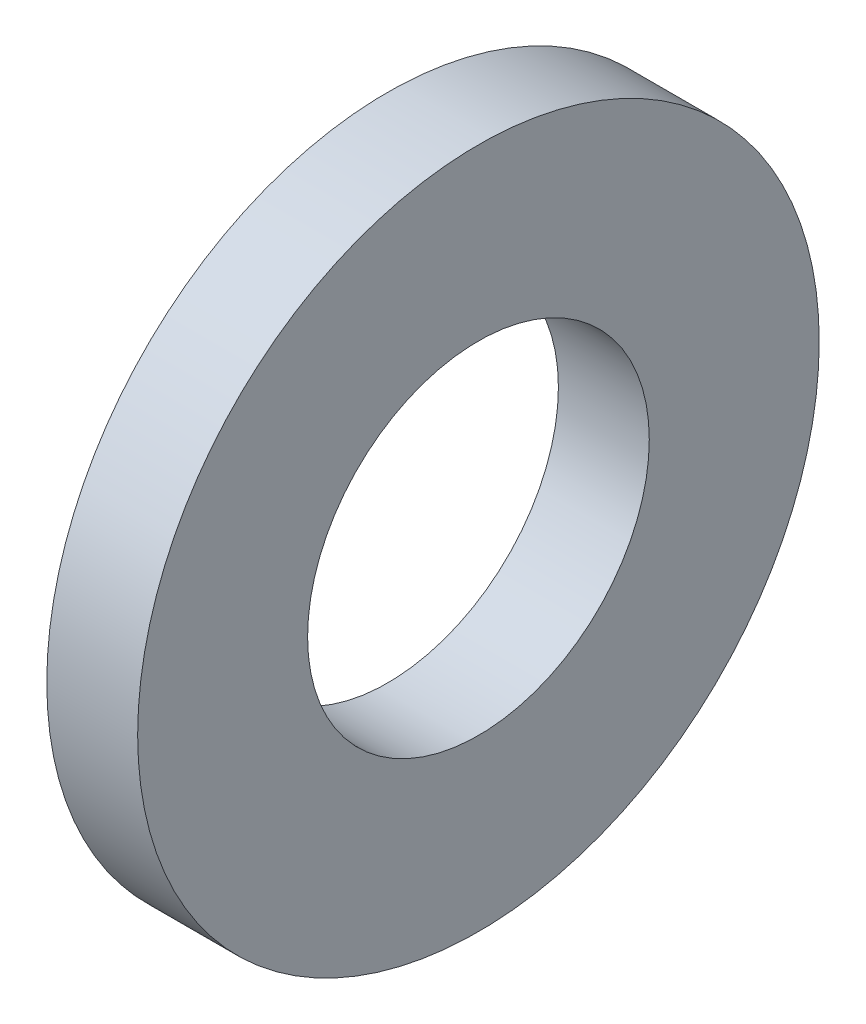
ISO-10303-21;
HEADER;
FILE_DESCRIPTION(('STEP AP214'),'2;1');
FILE_NAME('part.step','',(''),(''),'','','');
FILE_SCHEMA(('AUTOMOTIVE_DESIGN { 1 0 10303 214 1 1 1 1 }'));
ENDSEC;
DATA;
#1=APPLICATION_CONTEXT('core data for automotive mechanical design processes');
#2=APPLICATION_PROTOCOL_DEFINITION('international standard','automotive_design',2000,#1);
#3=PRODUCT_CONTEXT('',#1,'mechanical');
#4=PRODUCT('Part','Part','',(#3));
#5=PRODUCT_RELATED_PRODUCT_CATEGORY('part','',(#4));
#6=PRODUCT_DEFINITION_FORMATION('','',#4);
#7=PRODUCT_DEFINITION_CONTEXT('part definition',#1,'design');
#8=PRODUCT_DEFINITION('design','',#6,#7);
#9=PRODUCT_DEFINITION_SHAPE('','',#8);
#10=(LENGTH_UNIT() NAMED_UNIT(*) SI_UNIT(.MILLI.,.METRE.));
#11=(NAMED_UNIT(*) PLANE_ANGLE_UNIT() SI_UNIT($,.RADIAN.));
#12=(NAMED_UNIT(*) SI_UNIT($,.STERADIAN.) SOLID_ANGLE_UNIT());
#13=UNCERTAINTY_MEASURE_WITH_UNIT(LENGTH_MEASURE(1.E-05),#10,'distance_accuracy_value','');
#14=(GEOMETRIC_REPRESENTATION_CONTEXT(3) GLOBAL_UNCERTAINTY_ASSIGNED_CONTEXT((#13)) GLOBAL_UNIT_ASSIGNED_CONTEXT((#10,
#11,#12)) REPRESENTATION_CONTEXT('',''));
#15=CARTESIAN_POINT('',(0.,0.,0.));
#16=DIRECTION('',(0.,0.,1.));
#17=DIRECTION('',(1.,0.,0.));
#18=AXIS2_PLACEMENT_3D('',#15,#16,#17);
#19=CARTESIAN_POINT('',(0.635,0.,0.));
#20=DIRECTION('',(1.,0.,0.));
#21=DIRECTION('',(0.,0.,-1.));
#22=AXIS2_PLACEMENT_3D('',#19,#20,#21);
#23=PLANE('',#22);
#24=CARTESIAN_POINT('',(0.635,0.,0.));
#25=DIRECTION('',(1.,0.,0.));
#26=DIRECTION('',(0.,0.,-1.));
#27=AXIS2_PLACEMENT_3D('',#24,#25,#26);
#28=CIRCLE('',#27,2.38125);
#29=CARTESIAN_POINT('',(0.635,0.,-2.38125));
#30=VERTEX_POINT('',#29);
#31=EDGE_CURVE('E10',#30,#30,#28,.T.);
#32=ORIENTED_EDGE('',*,*,#31,.T.);
#33=EDGE_LOOP('',(#32));
#34=FACE_BOUND('',#33,.T.);
#35=CARTESIAN_POINT('',(0.635,0.,0.));
#36=DIRECTION('',(1.,0.,0.));
#37=DIRECTION('',(0.,0.,-1.));
#38=AXIS2_PLACEMENT_3D('',#35,#36,#37);
#39=CIRCLE('',#38,1.1938);
#40=CARTESIAN_POINT('',(0.635,0.,-1.1938));
#41=VERTEX_POINT('',#40);
#42=EDGE_CURVE('E45',#41,#41,#39,.T.);
#43=ORIENTED_EDGE('',*,*,#42,.F.);
#44=EDGE_LOOP('',(#43));
#45=FACE_BOUND('',#44,.T.);
#46=ADVANCED_FACE('F34',(#34,#45),#23,.T.);
#47=CARTESIAN_POINT('',(0.,0.,0.));
#48=DIRECTION('',(1.,0.,0.));
#49=DIRECTION('',(0.,0.,-1.));
#50=AXIS2_PLACEMENT_3D('',#47,#48,#49);
#51=PLANE('',#50);
#52=CARTESIAN_POINT('',(0.,0.,0.));
#53=DIRECTION('',(1.,0.,0.));
#54=DIRECTION('',(0.,0.,-1.));
#55=AXIS2_PLACEMENT_3D('',#52,#53,#54);
#56=CIRCLE('',#55,2.38125);
#57=CARTESIAN_POINT('',(0.,0.,-2.38125));
#58=VERTEX_POINT('',#57);
#59=EDGE_CURVE('E38',#58,#58,#56,.T.);
#60=ORIENTED_EDGE('',*,*,#59,.F.);
#61=EDGE_LOOP('',(#60));
#62=FACE_BOUND('',#61,.T.);
#63=CARTESIAN_POINT('',(0.,0.,0.));
#64=DIRECTION('',(1.,0.,0.));
#65=DIRECTION('',(0.,0.,-1.));
#66=AXIS2_PLACEMENT_3D('',#63,#64,#65);
#67=CIRCLE('',#66,1.1938);
#68=CARTESIAN_POINT('',(0.,0.,-1.1938));
#69=VERTEX_POINT('',#68);
#70=EDGE_CURVE('E47',#69,#69,#67,.T.);
#71=ORIENTED_EDGE('',*,*,#70,.T.);
#72=EDGE_LOOP('',(#71));
#73=FACE_BOUND('',#72,.T.);
#74=ADVANCED_FACE('F57',(#62,#73),#51,.F.);
#75=CARTESIAN_POINT('',(0.635,0.,0.));
#76=DIRECTION('',(-1.,0.,0.));
#77=DIRECTION('',(0.,0.,1.));
#78=AXIS2_PLACEMENT_3D('',#75,#76,#77);
#79=CYLINDRICAL_SURFACE('',#78,2.38125);
#80=ORIENTED_EDGE('',*,*,#31,.F.);
#81=EDGE_LOOP('',(#80));
#82=FACE_BOUND('',#81,.T.);
#83=ORIENTED_EDGE('',*,*,#59,.T.);
#84=EDGE_LOOP('',(#83));
#85=FACE_BOUND('',#84,.T.);
#86=ADVANCED_FACE('F36',(#82,#85),#79,.T.);
#87=CARTESIAN_POINT('',(0.635,0.,0.));
#88=DIRECTION('',(-1.,0.,0.));
#89=DIRECTION('',(0.,0.,1.));
#90=AXIS2_PLACEMENT_3D('',#87,#88,#89);
#91=CYLINDRICAL_SURFACE('',#90,1.1938);
#92=ORIENTED_EDGE('',*,*,#42,.T.);
#93=EDGE_LOOP('',(#92));
#94=FACE_BOUND('',#93,.T.);
#95=ORIENTED_EDGE('',*,*,#70,.F.);
#96=EDGE_LOOP('',(#95));
#97=FACE_BOUND('',#96,.T.);
#98=ADVANCED_FACE('F53',(#94,#97),#91,.F.);
#99=CLOSED_SHELL('',(#46,#74,#86,#98));
#100=MANIFOLD_SOLID_BREP('B2',#99);
#101=ADVANCED_BREP_SHAPE_REPRESENTATION('',(#18,#100),#14);
#102=SHAPE_DEFINITION_REPRESENTATION(#9,#101);
ENDSEC;
END-ISO-10303-21;
